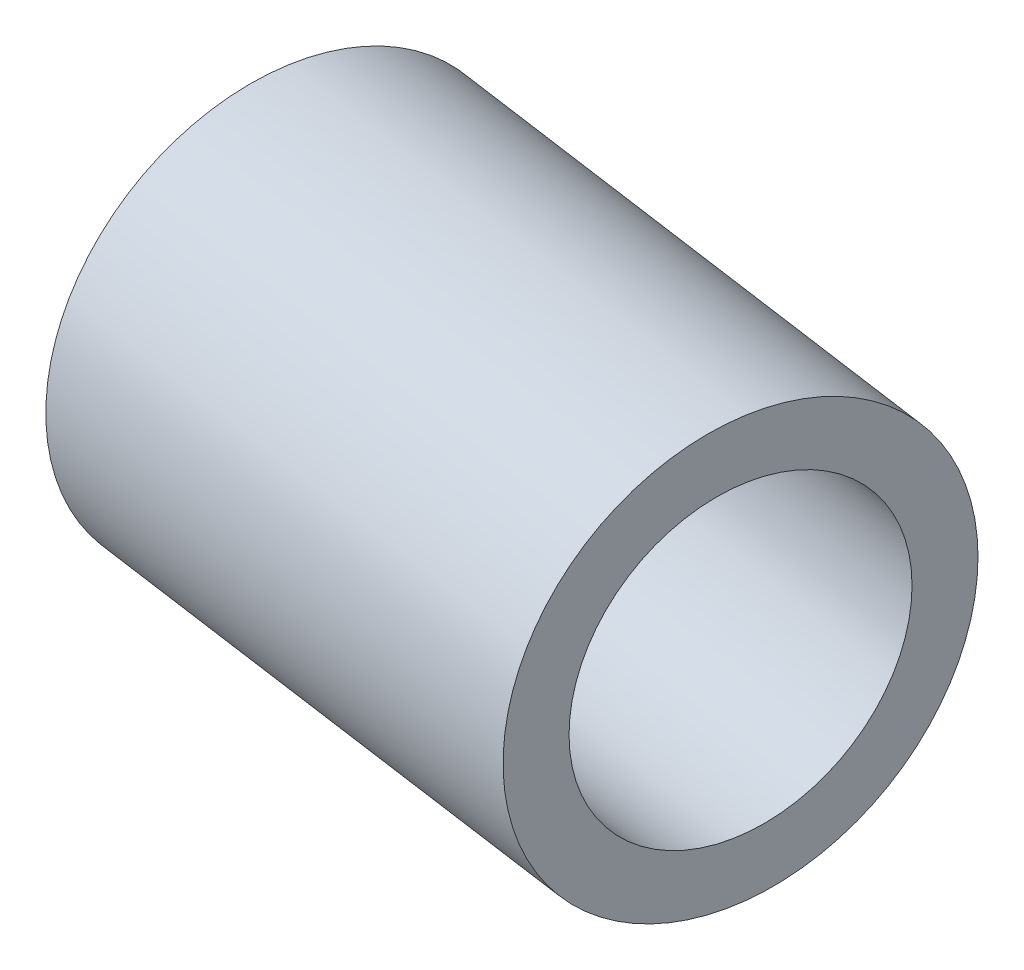
ISO-10303-21;
HEADER;
FILE_DESCRIPTION(('STEP AP214'),'2;1');
FILE_NAME('part.step','',(''),(''),'','','');
FILE_SCHEMA(('AUTOMOTIVE_DESIGN { 1 0 10303 214 1 1 1 1 }'));
ENDSEC;
DATA;
#1=APPLICATION_CONTEXT('core data for automotive mechanical design processes');
#2=APPLICATION_PROTOCOL_DEFINITION('international standard','automotive_design',2000,#1);
#3=PRODUCT_CONTEXT('',#1,'mechanical');
#4=PRODUCT('Part','Part','',(#3));
#5=PRODUCT_RELATED_PRODUCT_CATEGORY('part','',(#4));
#6=PRODUCT_DEFINITION_FORMATION('','',#4);
#7=PRODUCT_DEFINITION_CONTEXT('part definition',#1,'design');
#8=PRODUCT_DEFINITION('design','',#6,#7);
#9=PRODUCT_DEFINITION_SHAPE('','',#8);
#10=(LENGTH_UNIT() NAMED_UNIT(*) SI_UNIT(.MILLI.,.METRE.));
#11=(NAMED_UNIT(*) PLANE_ANGLE_UNIT() SI_UNIT($,.RADIAN.));
#12=(NAMED_UNIT(*) SI_UNIT($,.STERADIAN.) SOLID_ANGLE_UNIT());
#13=UNCERTAINTY_MEASURE_WITH_UNIT(LENGTH_MEASURE(1.E-05),#10,'distance_accuracy_value','');
#14=(GEOMETRIC_REPRESENTATION_CONTEXT(3) GLOBAL_UNCERTAINTY_ASSIGNED_CONTEXT((#13)) GLOBAL_UNIT_ASSIGNED_CONTEXT((#10,
#11,#12)) REPRESENTATION_CONTEXT('',''));
#15=CARTESIAN_POINT('',(0.,0.,0.));
#16=DIRECTION('',(0.,0.,1.));
#17=DIRECTION('',(1.,0.,0.));
#18=AXIS2_PLACEMENT_3D('',#15,#16,#17);
#19=CARTESIAN_POINT('',(86.3838908596988,-23.74921875,-404.480249297731));
#20=DIRECTION('',(0.990268068741571,0.,0.139173100960058));
#21=DIRECTION('',(0.139173100960058,0.,-0.990268068741571));
#22=AXIS2_PLACEMENT_3D('',#19,#20,#21);
#23=CYLINDRICAL_SURFACE('',#22,5.40078125001179);
#24=CARTESIAN_POINT('',(86.3838908596988,-23.74921875,-404.480249297731));
#25=DIRECTION('',(0.990268068741571,0.,0.139173100960058));
#26=DIRECTION('',(0.139173100960058,0.,-0.990268068741571));
#27=AXIS2_PLACEMENT_3D('',#24,#25,#26);
#28=CIRCLE('',#27,5.40078125001179);
#29=CARTESIAN_POINT('',(87.1355343338698,-23.74921875,-409.828470515876));
#30=VERTEX_POINT('',#29);
#31=EDGE_CURVE('E11',#30,#30,#28,.T.);
#32=CARTESIAN_POINT('',(100.05113750219,-23.74921875,-402.559443046512));
#33=DIRECTION('',(0.990268068741571,0.,0.139173100960058));
#34=DIRECTION('',(0.139173100960058,0.,-0.990268068741571));
#35=AXIS2_PLACEMENT_3D('',#32,#33,#34);
#36=CIRCLE('',#35,5.40078125001179);
#37=CARTESIAN_POINT('',(100.802780976361,-23.74921875,-407.907664264657));
#38=VERTEX_POINT('',#37);
#39=EDGE_CURVE('E48',#38,#38,#36,.T.);
#40=CARTESIAN_POINT('',(87.1355343338698,-23.74921875,-409.828470515876));
#41=CARTESIAN_POINT('',(87.2779014863958,-23.74921875,-409.808462117425));
#42=CARTESIAN_POINT('',(87.4202686389217,-23.74921875,-409.788453718975));
#43=CARTESIAN_POINT('',(87.7050029439736,-23.74921875,-409.748436922075));
#44=CARTESIAN_POINT('',(87.8473700964996,-23.74921875,-409.728428523625));
#45=CARTESIAN_POINT('',(88.1321044015515,-23.74921875,-409.688411726724));
#46=CARTESIAN_POINT('',(88.2744715540774,-23.74921875,-409.668403328274));
#47=CARTESIAN_POINT('',(88.5592058591293,-23.74921875,-409.628386531374));
#48=CARTESIAN_POINT('',(88.7015730116553,-23.74921875,-409.608378132923));
#49=CARTESIAN_POINT('',(88.9863073167072,-23.74921875,-409.568361336023));
#50=CARTESIAN_POINT('',(89.1286744692331,-23.74921875,-409.548352937573));
#51=CARTESIAN_POINT('',(89.413408774285,-23.74921875,-409.508336140672));
#52=CARTESIAN_POINT('',(89.555775926811,-23.74921875,-409.488327742222));
#53=CARTESIAN_POINT('',(89.8405102318629,-23.74921875,-409.448310945322));
#54=CARTESIAN_POINT('',(89.9828773843888,-23.74921875,-409.428302546872));
#55=CARTESIAN_POINT('',(90.2676116894407,-23.74921875,-409.388285749971));
#56=CARTESIAN_POINT('',(90.4099788419666,-23.74921875,-409.368277351521));
#57=CARTESIAN_POINT('',(90.6947131470186,-23.74921875,-409.328260554621));
#58=CARTESIAN_POINT('',(90.8370802995445,-23.74921875,-409.30825215617));
#59=CARTESIAN_POINT('',(91.1218146045964,-23.74921875,-409.26823535927));
#60=CARTESIAN_POINT('',(91.2641817571223,-23.74921875,-409.24822696082));
#61=CARTESIAN_POINT('',(91.5489160621742,-23.74921875,-409.208210163919));
#62=CARTESIAN_POINT('',(91.6912832147002,-23.74921875,-409.188201765469));
#63=CARTESIAN_POINT('',(91.9760175197521,-23.74921875,-409.148184968569));
#64=CARTESIAN_POINT('',(92.118384672278,-23.74921875,-409.128176570119));
#65=CARTESIAN_POINT('',(92.4031189773299,-23.74921875,-409.088159773218));
#66=CARTESIAN_POINT('',(92.5454861298559,-23.74921875,-409.068151374768));
#67=CARTESIAN_POINT('',(92.8302204349078,-23.74921875,-409.028134577868));
#68=CARTESIAN_POINT('',(92.9725875874337,-23.74921875,-409.008126179417));
#69=CARTESIAN_POINT('',(93.2573218924856,-23.74921875,-408.968109382517));
#70=CARTESIAN_POINT('',(93.3996890450116,-23.74921875,-408.948100984067));
#71=CARTESIAN_POINT('',(93.6844233500635,-23.74921875,-408.908084187167));
#72=CARTESIAN_POINT('',(93.8267905025894,-23.74921875,-408.888075788716));
#73=CARTESIAN_POINT('',(94.1115248076413,-23.74921875,-408.848058991816));
#74=CARTESIAN_POINT('',(94.2538919601673,-23.74921875,-408.828050593366));
#75=CARTESIAN_POINT('',(94.5386262652192,-23.74921875,-408.788033796465));
#76=CARTESIAN_POINT('',(94.6809934177451,-23.74921875,-408.768025398015));
#77=CARTESIAN_POINT('',(94.965727722797,-23.74921875,-408.728008601115));
#78=CARTESIAN_POINT('',(95.108094875323,-23.74921875,-408.708000202665));
#79=CARTESIAN_POINT('',(95.3928291803749,-23.74921875,-408.667983405764));
#80=CARTESIAN_POINT('',(95.5351963329008,-23.74921875,-408.647975007314));
#81=CARTESIAN_POINT('',(95.8199306379527,-23.74921875,-408.607958210413));
#82=CARTESIAN_POINT('',(95.9622977904787,-23.74921875,-408.587949811963));
#83=CARTESIAN_POINT('',(96.2470320955306,-23.74921875,-408.547933015063));
#84=CARTESIAN_POINT('',(96.3893992480565,-23.74921875,-408.527924616613));
#85=CARTESIAN_POINT('',(96.6741335531084,-23.74921875,-408.487907819712));
#86=CARTESIAN_POINT('',(96.8165007056344,-23.74921875,-408.467899421262));
#87=CARTESIAN_POINT('',(97.1012350106863,-23.74921875,-408.427882624362));
#88=CARTESIAN_POINT('',(97.2436021632122,-23.74921875,-408.407874225912));
#89=CARTESIAN_POINT('',(97.5283364682641,-23.74921875,-408.367857429011));
#90=CARTESIAN_POINT('',(97.6707036207901,-23.74921875,-408.347849030561));
#91=CARTESIAN_POINT('',(97.955437925842,-23.74921875,-408.307832233661));
#92=CARTESIAN_POINT('',(98.0978050783679,-23.74921875,-408.28782383521));
#93=CARTESIAN_POINT('',(98.3825393834198,-23.74921875,-408.24780703831));
#94=CARTESIAN_POINT('',(98.5249065359458,-23.74921875,-408.22779863986));
#95=CARTESIAN_POINT('',(98.8096408409976,-23.74921875,-408.187781842959));
#96=CARTESIAN_POINT('',(98.9520079935236,-23.74921875,-408.167773444509));
#97=CARTESIAN_POINT('',(99.2367422985755,-23.74921875,-408.127756647609));
#98=CARTESIAN_POINT('',(99.3791094511014,-23.74921875,-408.107748249159));
#99=CARTESIAN_POINT('',(99.6638437561534,-23.74921875,-408.067731452258));
#100=CARTESIAN_POINT('',(99.8062109086793,-23.74921875,-408.047723053808));
#101=CARTESIAN_POINT('',(100.090945213731,-23.74921875,-408.007706256908));
#102=CARTESIAN_POINT('',(100.233312366257,-23.74921875,-407.987697858457));
#103=CARTESIAN_POINT('',(100.518046671309,-23.74921875,-407.947681061557));
#104=CARTESIAN_POINT('',(100.660413823835,-23.74921875,-407.927672663107));
#105=CARTESIAN_POINT('',(100.802780976361,-23.74921875,-407.907664264657));
#106=B_SPLINE_CURVE_WITH_KNOTS('',3,(#40,#41,#42,#43,#44,#45,#46,#47,#48,#49,#50,#51,#52,#53,
#54,#55,#56,#57,#58,#59,#60,#61,#62,#63,#64,#65,#66,#67,#68,#69,#70,#71,#72,#73,#74,#75,#76,#77,
#78,#79,#80,#81,#82,#83,#84,#85,#86,#87,#88,#89,#90,#91,#92,#93,#94,#95,#96,#97,#98,#99,#100,
#101,#102,#103,#104,#105),.UNSPECIFIED.,.F.,.F.,(4,2,2,2,2,2,2,2,2,2,2,2,2,2,2,2,2,2,2,2,2,2,2,
2,2,2,2,2,2,2,2,2,4),(0.,0.431298828124988,0.86259765624999,1.29389648437499,1.7251953125,
2.156494140625,2.58779296874999,3.01909179687499,3.450390625,3.881689453125,4.31298828125,
4.74428710937499,5.1755859375,5.606884765625,6.03818359375,6.46948242187501,6.90078124999999,
7.33208007812499,7.76337890625,8.194677734375,8.62597656250001,9.05727539062501,9.48857421875,
9.919873046875,10.351171875,10.782470703125,11.21376953125,11.645068359375,12.0763671875,
12.507666015625,12.93896484375,13.370263671875,13.8015625),.UNSPECIFIED.);
#107=EDGE_CURVE('BSEAM45',#30,#38,#106,.T.);
#108=ORIENTED_EDGE('',*,*,#31,.T.);
#109=ORIENTED_EDGE('',*,*,#39,.F.);
#110=ORIENTED_EDGE('',*,*,#107,.T.);
#111=ORIENTED_EDGE('',*,*,#107,.F.);
#112=EDGE_LOOP('',(#108,#110,#109,#111));
#113=FACE_BOUND('',#112,.T.);
#114=ADVANCED_FACE('F45',(#113),#23,.T.);
#115=CARTESIAN_POINT('',(86.3838908596988,-23.74921875,-404.480249297731));
#116=DIRECTION('',(0.990268068741571,0.,0.139173100960058));
#117=DIRECTION('',(0.139173100960058,0.,-0.990268068741571));
#118=AXIS2_PLACEMENT_3D('',#115,#116,#117);
#119=PLANE('',#118);
#120=CARTESIAN_POINT('',(86.3838908596988,-23.74921875,-404.480249297731));
#121=DIRECTION('',(0.990268068741571,0.,0.139173100960058));
#122=DIRECTION('',(0.139173100960058,0.,-0.990268068741571));
#123=AXIS2_PLACEMENT_3D('',#120,#121,#122);
#124=CIRCLE('',#123,3.90078124999991);
#125=CARTESIAN_POINT('',(86.9267746824281,-23.74921875,-408.343068412751));
#126=VERTEX_POINT('',#125);
#127=EDGE_CURVE('E55',#126,#126,#124,.T.);
#128=ORIENTED_EDGE('',*,*,#127,.T.);
#129=EDGE_LOOP('',(#128));
#130=FACE_BOUND('',#129,.T.);
#131=ORIENTED_EDGE('',*,*,#31,.F.);
#132=EDGE_LOOP('',(#131));
#133=FACE_BOUND('',#132,.T.);
#134=ADVANCED_FACE('F63',(#130,#133),#119,.F.);
#135=CARTESIAN_POINT('',(100.05113750219,-23.74921875,-402.559443046512));
#136=DIRECTION('',(0.990268068741571,0.,0.139173100960058));
#137=DIRECTION('',(0.139173100960058,0.,-0.990268068741571));
#138=AXIS2_PLACEMENT_3D('',#135,#136,#137);
#139=PLANE('',#138);
#140=CARTESIAN_POINT('',(100.05113750219,-23.74921875,-402.559443046512));
#141=DIRECTION('',(0.990268068741571,0.,0.139173100960058));
#142=DIRECTION('',(0.139173100960058,0.,-0.990268068741571));
#143=AXIS2_PLACEMENT_3D('',#140,#141,#142);
#144=CIRCLE('',#143,3.90078124999991);
#145=CARTESIAN_POINT('',(100.594021324919,-23.74921875,-406.422262161532));
#146=VERTEX_POINT('',#145);
#147=EDGE_CURVE('E57',#146,#146,#144,.T.);
#148=ORIENTED_EDGE('',*,*,#147,.F.);
#149=EDGE_LOOP('',(#148));
#150=FACE_BOUND('',#149,.T.);
#151=ORIENTED_EDGE('',*,*,#39,.T.);
#152=EDGE_LOOP('',(#151));
#153=FACE_BOUND('',#152,.T.);
#154=ADVANCED_FACE('F69',(#150,#153),#139,.T.);
#155=CARTESIAN_POINT('',(86.3838908596988,-23.74921875,-404.480249297731));
#156=DIRECTION('',(0.990268068741571,0.,0.139173100960058));
#157=DIRECTION('',(0.139173100960058,0.,-0.990268068741571));
#158=AXIS2_PLACEMENT_3D('',#155,#156,#157);
#159=CYLINDRICAL_SURFACE('',#158,3.90078124999991);
#160=CARTESIAN_POINT('',(86.9267746824281,-23.74921875,-408.343068412751));
#161=CARTESIAN_POINT('',(87.069141834954,-23.74921875,-408.323060014301));
#162=CARTESIAN_POINT('',(87.21150898748,-23.74921875,-408.303051615851));
#163=CARTESIAN_POINT('',(87.4962432925319,-23.74921875,-408.263034818951));
#164=CARTESIAN_POINT('',(87.6386104450578,-23.74921875,-408.2430264205));
#165=CARTESIAN_POINT('',(87.9233447501097,-23.74921875,-408.2030096236));
#166=CARTESIAN_POINT('',(88.0657119026357,-23.74921875,-408.18300122515));
#167=CARTESIAN_POINT('',(88.3504462076876,-23.74921875,-408.142984428249));
#168=CARTESIAN_POINT('',(88.4928133602135,-23.74921875,-408.122976029799));
#169=CARTESIAN_POINT('',(88.7775476652654,-23.74921875,-408.082959232899));
#170=CARTESIAN_POINT('',(88.9199148177914,-23.74921875,-408.062950834449));
#171=CARTESIAN_POINT('',(89.2046491228433,-23.74921875,-408.022934037548));
#172=CARTESIAN_POINT('',(89.3470162753692,-23.74921875,-408.002925639098));
#173=CARTESIAN_POINT('',(89.6317505804211,-23.74921875,-407.962908842198));
#174=CARTESIAN_POINT('',(89.774117732947,-23.74921875,-407.942900443747));
#175=CARTESIAN_POINT('',(90.058852037999,-23.74921875,-407.902883646847));
#176=CARTESIAN_POINT('',(90.2012191905249,-23.74921875,-407.882875248397));
#177=CARTESIAN_POINT('',(90.4859534955768,-23.74921875,-407.842858451497));
#178=CARTESIAN_POINT('',(90.6283206481027,-23.74921875,-407.822850053046));
#179=CARTESIAN_POINT('',(90.9130549531547,-23.74921875,-407.782833256146));
#180=CARTESIAN_POINT('',(91.0554221056806,-23.74921875,-407.762824857696));
#181=CARTESIAN_POINT('',(91.3401564107325,-23.74921875,-407.722808060795));
#182=CARTESIAN_POINT('',(91.4825235632585,-23.74921875,-407.702799662345));
#183=CARTESIAN_POINT('',(91.7672578683103,-23.74921875,-407.662782865445));
#184=CARTESIAN_POINT('',(91.9096250208363,-23.74921875,-407.642774466995));
#185=CARTESIAN_POINT('',(92.1943593258882,-23.74921875,-407.602757670094));
#186=CARTESIAN_POINT('',(92.3367264784141,-23.74921875,-407.582749271644));
#187=CARTESIAN_POINT('',(92.621460783466,-23.74921875,-407.542732474744));
#188=CARTESIAN_POINT('',(92.763827935992,-23.74921875,-407.522724076293));
#189=CARTESIAN_POINT('',(93.0485622410439,-23.74921875,-407.482707279393));
#190=CARTESIAN_POINT('',(93.1909293935698,-23.74921875,-407.462698880943));
#191=CARTESIAN_POINT('',(93.4756636986217,-23.74921875,-407.422682084042));
#192=CARTESIAN_POINT('',(93.6180308511477,-23.74921875,-407.402673685592));
#193=CARTESIAN_POINT('',(93.9027651561996,-23.74921875,-407.362656888692));
#194=CARTESIAN_POINT('',(94.0451323087255,-23.74921875,-407.342648490242));
#195=CARTESIAN_POINT('',(94.3298666137774,-23.74921875,-407.302631693341));
#196=CARTESIAN_POINT('',(94.4722337663034,-23.74921875,-407.282623294891));
#197=CARTESIAN_POINT('',(94.7569680713553,-23.74921875,-407.242606497991));
#198=CARTESIAN_POINT('',(94.8993352238812,-23.74921875,-407.22259809954));
#199=CARTESIAN_POINT('',(95.1840695289331,-23.74921875,-407.18258130264));
#200=CARTESIAN_POINT('',(95.3264366814591,-23.74921875,-407.16257290419));
#201=CARTESIAN_POINT('',(95.611170986511,-23.74921875,-407.122556107289));
#202=CARTESIAN_POINT('',(95.7535381390369,-23.74921875,-407.102547708839));
#203=CARTESIAN_POINT('',(96.0382724440888,-23.74921875,-407.062530911939));
#204=CARTESIAN_POINT('',(96.1806395966148,-23.74921875,-407.042522513489));
#205=CARTESIAN_POINT('',(96.4653739016667,-23.74921875,-407.002505716588));
#206=CARTESIAN_POINT('',(96.6077410541926,-23.74921875,-406.982497318138));
#207=CARTESIAN_POINT('',(96.8924753592445,-23.74921875,-406.942480521238));
#208=CARTESIAN_POINT('',(97.0348425117704,-23.74921875,-406.922472122787));
#209=CARTESIAN_POINT('',(97.3195768168224,-23.74921875,-406.882455325887));
#210=CARTESIAN_POINT('',(97.4619439693483,-23.74921875,-406.862446927437));
#211=CARTESIAN_POINT('',(97.7466782744002,-23.74921875,-406.822430130536));
#212=CARTESIAN_POINT('',(97.8890454269262,-23.74921875,-406.802421732086));
#213=CARTESIAN_POINT('',(98.1737797319781,-23.74921875,-406.762404935186));
#214=CARTESIAN_POINT('',(98.316146884504,-23.74921875,-406.742396536736));
#215=CARTESIAN_POINT('',(98.6008811895559,-23.74921875,-406.702379739835));
#216=CARTESIAN_POINT('',(98.7432483420819,-23.74921875,-406.682371341385));
#217=CARTESIAN_POINT('',(99.0279826471338,-23.74921875,-406.642354544485));
#218=CARTESIAN_POINT('',(99.1703497996597,-23.74921875,-406.622346146034));
#219=CARTESIAN_POINT('',(99.4550841047116,-23.74921875,-406.582329349134));
#220=CARTESIAN_POINT('',(99.5974512572375,-23.74921875,-406.562320950684));
#221=CARTESIAN_POINT('',(99.8821855622895,-23.74921875,-406.522304153783));
#222=CARTESIAN_POINT('',(100.024552714815,-23.74921875,-406.502295755333));
#223=CARTESIAN_POINT('',(100.309287019867,-23.74921875,-406.462278958433));
#224=CARTESIAN_POINT('',(100.451654172393,-23.74921875,-406.442270559983));
#225=CARTESIAN_POINT('',(100.594021324919,-23.74921875,-406.422262161532));
#226=B_SPLINE_CURVE_WITH_KNOTS('',3,(#160,#161,#162,#163,#164,#165,#166,#167,#168,#169,#170,
#171,#172,#173,#174,#175,#176,#177,#178,#179,#180,#181,#182,#183,#184,#185,#186,#187,#188,#189,
#190,#191,#192,#193,#194,#195,#196,#197,#198,#199,#200,#201,#202,#203,#204,#205,#206,#207,#208,
#209,#210,#211,#212,#213,#214,#215,#216,#217,#218,#219,#220,#221,#222,#223,#224,#225),
.UNSPECIFIED.,.F.,.F.,(4,2,2,2,2,2,2,2,2,2,2,2,2,2,2,2,2,2,2,2,2,2,2,2,2,2,2,2,2,2,2,2,4),(0.,
0.431298828125002,0.862597656250004,1.29389648437501,1.72519531250002,2.15649414062502,
2.58779296875001,3.01909179687501,3.45039062500001,3.88168945312501,4.31298828125002,
4.744287109375,5.17558593750001,5.60688476562501,6.03818359375002,6.46948242187502,
6.90078125000002,7.33208007812501,7.76337890625001,8.19467773437501,8.62597656250002,
9.05727539062503,9.48857421875001,9.91987304687502,10.351171875,10.782470703125,11.21376953125,
11.645068359375,12.0763671875,12.507666015625,12.93896484375,13.370263671875,13.8015625),.UNSPECIFIED.);
#227=EDGE_CURVE('BSEAM66',#126,#146,#226,.T.);
#228=ORIENTED_EDGE('',*,*,#127,.F.);
#229=ORIENTED_EDGE('',*,*,#147,.T.);
#230=ORIENTED_EDGE('',*,*,#227,.T.);
#231=ORIENTED_EDGE('',*,*,#227,.F.);
#232=EDGE_LOOP('',(#228,#230,#229,#231));
#233=FACE_BOUND('',#232,.T.);
#234=ADVANCED_FACE('F66',(#233),#159,.F.);
#235=CLOSED_SHELL('',(#114,#134,#154,#234));
#236=MANIFOLD_SOLID_BREP('B2',#235);
#237=ADVANCED_BREP_SHAPE_REPRESENTATION('',(#18,#236),#14);
#238=SHAPE_DEFINITION_REPRESENTATION(#9,#237);
ENDSEC;
END-ISO-10303-21;
